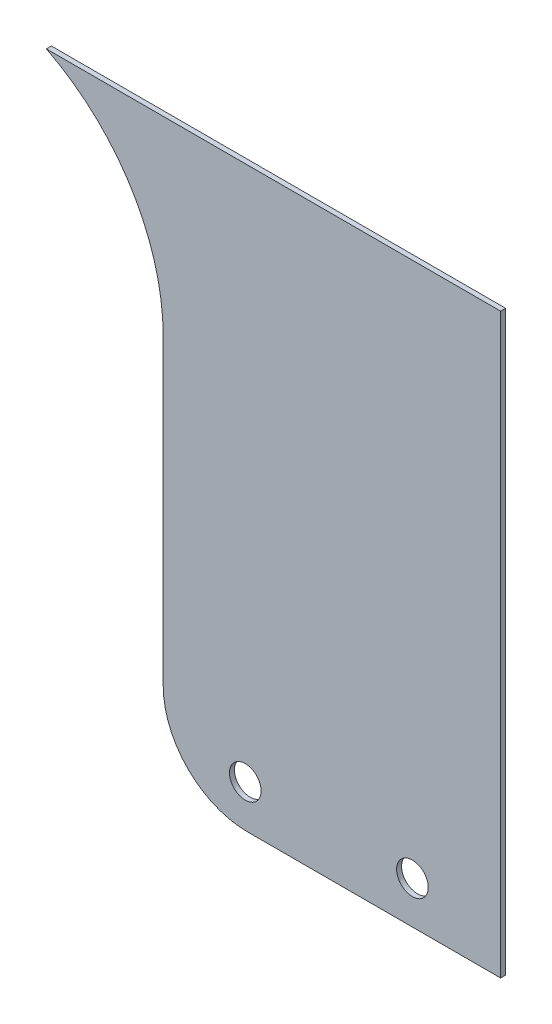
ISO-10303-21;
HEADER;
FILE_DESCRIPTION(('STEP AP214'),'2;1');
FILE_NAME('part.step','',(''),(''),'','','');
FILE_SCHEMA(('AUTOMOTIVE_DESIGN { 1 0 10303 214 1 1 1 1 }'));
ENDSEC;
DATA;
#1=APPLICATION_CONTEXT('core data for automotive mechanical design processes');
#2=APPLICATION_PROTOCOL_DEFINITION('international standard','automotive_design',2000,#1);
#3=PRODUCT_CONTEXT('',#1,'mechanical');
#4=PRODUCT('Part','Part','',(#3));
#5=PRODUCT_RELATED_PRODUCT_CATEGORY('part','',(#4));
#6=PRODUCT_DEFINITION_FORMATION('','',#4);
#7=PRODUCT_DEFINITION_CONTEXT('part definition',#1,'design');
#8=PRODUCT_DEFINITION('design','',#6,#7);
#9=PRODUCT_DEFINITION_SHAPE('','',#8);
#10=(LENGTH_UNIT() NAMED_UNIT(*) SI_UNIT(.MILLI.,.METRE.));
#11=(NAMED_UNIT(*) PLANE_ANGLE_UNIT() SI_UNIT($,.RADIAN.));
#12=(NAMED_UNIT(*) SI_UNIT($,.STERADIAN.) SOLID_ANGLE_UNIT());
#13=UNCERTAINTY_MEASURE_WITH_UNIT(LENGTH_MEASURE(1.E-05),#10,'distance_accuracy_value','');
#14=(GEOMETRIC_REPRESENTATION_CONTEXT(3) GLOBAL_UNCERTAINTY_ASSIGNED_CONTEXT((#13)) GLOBAL_UNIT_ASSIGNED_CONTEXT((#10,
#11,#12)) REPRESENTATION_CONTEXT('',''));
#15=CARTESIAN_POINT('',(0.,0.,0.));
#16=DIRECTION('',(0.,0.,1.));
#17=DIRECTION('',(1.,0.,0.));
#18=AXIS2_PLACEMENT_3D('',#15,#16,#17);
#19=CARTESIAN_POINT('',(-494.375,813.93,166.6));
#20=DIRECTION('',(0.,0.,-1.));
#21=DIRECTION('',(-1.,0.,0.));
#22=AXIS2_PLACEMENT_3D('',#19,#20,#21);
#23=PLANE('',#22);
#24=CARTESIAN_POINT('',(-444.7375,801.23,166.6));
#25=DIRECTION('',(0.,0.,1.));
#26=DIRECTION('',(1.,0.,0.));
#27=AXIS2_PLACEMENT_3D('',#24,#25,#26);
#28=CIRCLE('',#27,4.76250000000003);
#29=CARTESIAN_POINT('',(-439.975,801.23,166.6));
#30=VERTEX_POINT('',#29);
#31=EDGE_CURVE('E147',#30,#30,#28,.T.);
#32=ORIENTED_EDGE('',*,*,#31,.F.);
#33=EDGE_LOOP('',(#32));
#34=FACE_BOUND('',#33,.T.);
#35=DIRECTION('',(0.,1.,0.));
#36=VECTOR('',#35,1.);
#37=CARTESIAN_POINT('',(-418.175,962.43,166.6));
#38=LINE('',#37,#36);
#39=CARTESIAN_POINT('',(-418.175,788.53,166.6));
#40=VERTEX_POINT('',#39);
#41=CARTESIAN_POINT('',(-418.175,962.43,166.6));
#42=VERTEX_POINT('',#41);
#43=EDGE_CURVE('E158',#40,#42,#38,.T.);
#44=ORIENTED_EDGE('',*,*,#43,.T.);
#45=DIRECTION('',(-1.,0.,0.));
#46=VECTOR('',#45,1.);
#47=CARTESIAN_POINT('',(-418.175,962.43,166.6));
#48=LINE('',#47,#46);
#49=CARTESIAN_POINT('',(-554.955743447679,962.43,166.6));
#50=VERTEX_POINT('',#49);
#51=EDGE_CURVE('E104',#42,#50,#48,.T.);
#52=ORIENTED_EDGE('',*,*,#51,.T.);
#53=CARTESIAN_POINT('',(-584.199999999973,905.024825288131,166.6));
#54=DIRECTION('',(0.,0.,-1.));
#55=DIRECTION('',(1.,0.,0.));
#56=AXIS2_PLACEMENT_3D('',#53,#54,#55);
#57=CIRCLE('',#56,64.4249999999732);
#58=CARTESIAN_POINT('',(-519.775,905.024825288126,166.6));
#59=VERTEX_POINT('',#58);
#60=EDGE_CURVE('E119',#50,#59,#57,.T.);
#61=ORIENTED_EDGE('',*,*,#60,.T.);
#62=DIRECTION('',(0.,-1.,0.));
#63=VECTOR('',#62,1.);
#64=CARTESIAN_POINT('',(-519.775,813.93,166.6));
#65=LINE('',#64,#63);
#66=CARTESIAN_POINT('',(-519.775,813.93,166.6));
#67=VERTEX_POINT('',#66);
#68=EDGE_CURVE('E113',#59,#67,#65,.T.);
#69=ORIENTED_EDGE('',*,*,#68,.T.);
#70=CARTESIAN_POINT('',(-494.375,813.93,166.6));
#71=DIRECTION('',(0.,0.,1.));
#72=DIRECTION('',(-1.,0.,0.));
#73=AXIS2_PLACEMENT_3D('',#70,#71,#72);
#74=CIRCLE('',#73,25.4);
#75=CARTESIAN_POINT('',(-494.375,788.53,166.6));
#76=VERTEX_POINT('',#75);
#77=EDGE_CURVE('E117',#67,#76,#74,.T.);
#78=ORIENTED_EDGE('',*,*,#77,.T.);
#79=DIRECTION('',(1.,0.,0.));
#80=VECTOR('',#79,1.);
#81=CARTESIAN_POINT('',(-418.175,788.53,166.6));
#82=LINE('',#81,#80);
#83=EDGE_CURVE('E59',#76,#40,#82,.T.);
#84=ORIENTED_EDGE('',*,*,#83,.T.);
#85=EDGE_LOOP('',(#44,#52,#61,#69,#78,#84));
#86=FACE_BOUND('',#85,.T.);
#87=CARTESIAN_POINT('',(-495.0625,801.23,166.6));
#88=DIRECTION('',(0.,0.,1.));
#89=DIRECTION('',(1.,0.,0.));
#90=AXIS2_PLACEMENT_3D('',#87,#88,#89);
#91=CIRCLE('',#90,4.76250000000003);
#92=CARTESIAN_POINT('',(-490.3,801.23,166.6));
#93=VERTEX_POINT('',#92);
#94=EDGE_CURVE('E207',#93,#93,#91,.T.);
#95=ORIENTED_EDGE('',*,*,#94,.F.);
#96=EDGE_LOOP('',(#95));
#97=FACE_BOUND('',#96,.T.);
#98=ADVANCED_FACE('F39',(#34,#86,#97),#23,.F.);
#99=CARTESIAN_POINT('',(-494.375,813.93,165.1));
#100=DIRECTION('',(0.,0.,-1.));
#101=DIRECTION('',(-1.,0.,0.));
#102=AXIS2_PLACEMENT_3D('',#99,#100,#101);
#103=PLANE('',#102);
#104=CARTESIAN_POINT('',(-444.7375,801.23,165.1));
#105=DIRECTION('',(0.,0.,1.));
#106=DIRECTION('',(1.,0.,0.));
#107=AXIS2_PLACEMENT_3D('',#104,#105,#106);
#108=CIRCLE('',#107,4.76250000000003);
#109=CARTESIAN_POINT('',(-439.975,801.23,165.1));
#110=VERTEX_POINT('',#109);
#111=EDGE_CURVE('E215',#110,#110,#108,.T.);
#112=ORIENTED_EDGE('',*,*,#111,.T.);
#113=EDGE_LOOP('',(#112));
#114=FACE_BOUND('',#113,.T.);
#115=DIRECTION('',(0.,1.,0.));
#116=VECTOR('',#115,1.);
#117=CARTESIAN_POINT('',(-418.175,962.43,165.1));
#118=LINE('',#117,#116);
#119=CARTESIAN_POINT('',(-418.175,788.53,165.1));
#120=VERTEX_POINT('',#119);
#121=CARTESIAN_POINT('',(-418.175,962.43,165.1));
#122=VERTEX_POINT('',#121);
#123=EDGE_CURVE('E142',#120,#122,#118,.T.);
#124=ORIENTED_EDGE('',*,*,#123,.F.);
#125=DIRECTION('',(1.,0.,0.));
#126=VECTOR('',#125,1.);
#127=CARTESIAN_POINT('',(-418.175,788.53,165.1));
#128=LINE('',#127,#126);
#129=CARTESIAN_POINT('',(-494.375,788.53,165.1));
#130=VERTEX_POINT('',#129);
#131=EDGE_CURVE('E94',#130,#120,#128,.T.);
#132=ORIENTED_EDGE('',*,*,#131,.F.);
#133=CARTESIAN_POINT('',(-494.375,813.93,165.1));
#134=DIRECTION('',(0.,0.,1.));
#135=DIRECTION('',(-1.,0.,0.));
#136=AXIS2_PLACEMENT_3D('',#133,#134,#135);
#137=CIRCLE('',#136,25.4);
#138=CARTESIAN_POINT('',(-519.775,813.93,165.1));
#139=VERTEX_POINT('',#138);
#140=EDGE_CURVE('E88',#139,#130,#137,.T.);
#141=ORIENTED_EDGE('',*,*,#140,.F.);
#142=DIRECTION('',(0.,-1.,0.));
#143=VECTOR('',#142,1.);
#144=CARTESIAN_POINT('',(-519.775,813.93,165.1));
#145=LINE('',#144,#143);
#146=CARTESIAN_POINT('',(-519.775,905.024825288126,165.1));
#147=VERTEX_POINT('',#146);
#148=EDGE_CURVE('E128',#147,#139,#145,.T.);
#149=ORIENTED_EDGE('',*,*,#148,.F.);
#150=CARTESIAN_POINT('',(-584.199999999973,905.024825288131,165.1));
#151=DIRECTION('',(0.,0.,-1.));
#152=DIRECTION('',(1.,0.,0.));
#153=AXIS2_PLACEMENT_3D('',#150,#151,#152);
#154=CIRCLE('',#153,64.4249999999732);
#155=CARTESIAN_POINT('',(-554.955743447679,962.43,165.1));
#156=VERTEX_POINT('',#155);
#157=EDGE_CURVE('E150',#156,#147,#154,.T.);
#158=ORIENTED_EDGE('',*,*,#157,.F.);
#159=DIRECTION('',(-1.,0.,0.));
#160=VECTOR('',#159,1.);
#161=CARTESIAN_POINT('',(-418.175,962.43,165.1));
#162=LINE('',#161,#160);
#163=EDGE_CURVE('E146',#122,#156,#162,.T.);
#164=ORIENTED_EDGE('',*,*,#163,.F.);
#165=EDGE_LOOP('',(#124,#132,#141,#149,#158,#164));
#166=FACE_BOUND('',#165,.T.);
#167=CARTESIAN_POINT('',(-495.0625,801.23,165.1));
#168=DIRECTION('',(0.,0.,1.));
#169=DIRECTION('',(1.,0.,0.));
#170=AXIS2_PLACEMENT_3D('',#167,#168,#169);
#171=CIRCLE('',#170,4.76250000000003);
#172=CARTESIAN_POINT('',(-490.3,801.23,165.1));
#173=VERTEX_POINT('',#172);
#174=EDGE_CURVE('E210',#173,#173,#171,.T.);
#175=ORIENTED_EDGE('',*,*,#174,.T.);
#176=EDGE_LOOP('',(#175));
#177=FACE_BOUND('',#176,.T.);
#178=ADVANCED_FACE('F173',(#114,#166,#177),#103,.T.);
#179=CARTESIAN_POINT('',(-418.175,962.43,166.6));
#180=DIRECTION('',(-1.,0.,0.));
#181=DIRECTION('',(0.,0.,1.));
#182=AXIS2_PLACEMENT_3D('',#179,#180,#181);
#183=PLANE('',#182);
#184=ORIENTED_EDGE('',*,*,#123,.T.);
#185=DIRECTION('',(0.,0.,-1.));
#186=VECTOR('',#185,1.);
#187=CARTESIAN_POINT('',(-418.175,962.43,166.6));
#188=LINE('',#187,#186);
#189=EDGE_CURVE('E11',#42,#122,#188,.T.);
#190=ORIENTED_EDGE('',*,*,#189,.F.);
#191=ORIENTED_EDGE('',*,*,#43,.F.);
#192=DIRECTION('',(0.,0.,-1.));
#193=VECTOR('',#192,1.);
#194=CARTESIAN_POINT('',(-418.175,788.53,166.6));
#195=LINE('',#194,#193);
#196=EDGE_CURVE('E138',#40,#120,#195,.T.);
#197=ORIENTED_EDGE('',*,*,#196,.T.);
#198=EDGE_LOOP('',(#184,#190,#191,#197));
#199=FACE_BOUND('',#198,.T.);
#200=ADVANCED_FACE('F41',(#199),#183,.F.);
#201=CARTESIAN_POINT('',(-418.175,962.43,166.6));
#202=DIRECTION('',(0.,-1.,0.));
#203=DIRECTION('',(0.,0.,-1.));
#204=AXIS2_PLACEMENT_3D('',#201,#202,#203);
#205=PLANE('',#204);
#206=ORIENTED_EDGE('',*,*,#163,.T.);
#207=DIRECTION('',(0.,0.,-1.));
#208=VECTOR('',#207,1.);
#209=CARTESIAN_POINT('',(-554.955743447679,962.43,166.6));
#210=LINE('',#209,#208);
#211=EDGE_CURVE('E49',#50,#156,#210,.T.);
#212=ORIENTED_EDGE('',*,*,#211,.F.);
#213=ORIENTED_EDGE('',*,*,#51,.F.);
#214=ORIENTED_EDGE('',*,*,#189,.T.);
#215=EDGE_LOOP('',(#206,#212,#213,#214));
#216=FACE_BOUND('',#215,.T.);
#217=ADVANCED_FACE('F258',(#216),#205,.F.);
#218=CARTESIAN_POINT('',(-584.199999999973,905.024825288131,166.6));
#219=DIRECTION('',(0.,0.,-1.));
#220=DIRECTION('',(-1.,0.,0.));
#221=AXIS2_PLACEMENT_3D('',#218,#219,#220);
#222=CYLINDRICAL_SURFACE('',#221,64.4249999999732);
#223=ORIENTED_EDGE('',*,*,#157,.T.);
#224=DIRECTION('',(0.,0.,-1.));
#225=VECTOR('',#224,1.);
#226=CARTESIAN_POINT('',(-519.775,905.024825288126,166.6));
#227=LINE('',#226,#225);
#228=EDGE_CURVE('E130',#59,#147,#227,.T.);
#229=ORIENTED_EDGE('',*,*,#228,.F.);
#230=ORIENTED_EDGE('',*,*,#60,.F.);
#231=ORIENTED_EDGE('',*,*,#211,.T.);
#232=EDGE_LOOP('',(#223,#229,#230,#231));
#233=FACE_BOUND('',#232,.T.);
#234=ADVANCED_FACE('F170',(#233),#222,.F.);
#235=CARTESIAN_POINT('',(-519.775,813.93,166.6));
#236=DIRECTION('',(1.,0.,0.));
#237=DIRECTION('',(0.,0.,-1.));
#238=AXIS2_PLACEMENT_3D('',#235,#236,#237);
#239=PLANE('',#238);
#240=ORIENTED_EDGE('',*,*,#148,.T.);
#241=DIRECTION('',(0.,0.,-1.));
#242=VECTOR('',#241,1.);
#243=CARTESIAN_POINT('',(-519.775,813.93,166.6));
#244=LINE('',#243,#242);
#245=EDGE_CURVE('E125',#67,#139,#244,.T.);
#246=ORIENTED_EDGE('',*,*,#245,.F.);
#247=ORIENTED_EDGE('',*,*,#68,.F.);
#248=ORIENTED_EDGE('',*,*,#228,.T.);
#249=EDGE_LOOP('',(#240,#246,#247,#248));
#250=FACE_BOUND('',#249,.T.);
#251=ADVANCED_FACE('F126',(#250),#239,.F.);
#252=CARTESIAN_POINT('',(-494.375,813.93,166.6));
#253=DIRECTION('',(0.,0.,-1.));
#254=DIRECTION('',(-1.,0.,0.));
#255=AXIS2_PLACEMENT_3D('',#252,#253,#254);
#256=CYLINDRICAL_SURFACE('',#255,25.4);
#257=ORIENTED_EDGE('',*,*,#140,.T.);
#258=DIRECTION('',(0.,0.,-1.));
#259=VECTOR('',#258,1.);
#260=CARTESIAN_POINT('',(-494.375,788.53,166.6));
#261=LINE('',#260,#259);
#262=EDGE_CURVE('E131',#76,#130,#261,.T.);
#263=ORIENTED_EDGE('',*,*,#262,.F.);
#264=ORIENTED_EDGE('',*,*,#77,.F.);
#265=ORIENTED_EDGE('',*,*,#245,.T.);
#266=EDGE_LOOP('',(#257,#263,#264,#265));
#267=FACE_BOUND('',#266,.T.);
#268=ADVANCED_FACE('F133',(#267),#256,.T.);
#269=CARTESIAN_POINT('',(-418.175,788.53,166.6));
#270=DIRECTION('',(0.,1.,0.));
#271=DIRECTION('',(0.,0.,1.));
#272=AXIS2_PLACEMENT_3D('',#269,#270,#271);
#273=PLANE('',#272);
#274=ORIENTED_EDGE('',*,*,#131,.T.);
#275=ORIENTED_EDGE('',*,*,#196,.F.);
#276=ORIENTED_EDGE('',*,*,#83,.F.);
#277=ORIENTED_EDGE('',*,*,#262,.T.);
#278=EDGE_LOOP('',(#274,#275,#276,#277));
#279=FACE_BOUND('',#278,.T.);
#280=ADVANCED_FACE('F178',(#279),#273,.F.);
#281=CARTESIAN_POINT('',(-444.7375,801.23,166.6));
#282=DIRECTION('',(0.,0.,-1.));
#283=DIRECTION('',(-1.,0.,0.));
#284=AXIS2_PLACEMENT_3D('',#281,#282,#283);
#285=CYLINDRICAL_SURFACE('',#284,4.76250000000003);
#286=ORIENTED_EDGE('',*,*,#31,.T.);
#287=EDGE_LOOP('',(#286));
#288=FACE_BOUND('',#287,.T.);
#289=ORIENTED_EDGE('',*,*,#111,.F.);
#290=EDGE_LOOP('',(#289));
#291=FACE_BOUND('',#290,.T.);
#292=ADVANCED_FACE('F180',(#288,#291),#285,.F.);
#293=CARTESIAN_POINT('',(-495.0625,801.23,166.6));
#294=DIRECTION('',(0.,0.,-1.));
#295=DIRECTION('',(-1.,0.,0.));
#296=AXIS2_PLACEMENT_3D('',#293,#294,#295);
#297=CYLINDRICAL_SURFACE('',#296,4.76250000000003);
#298=ORIENTED_EDGE('',*,*,#94,.T.);
#299=EDGE_LOOP('',(#298));
#300=FACE_BOUND('',#299,.T.);
#301=ORIENTED_EDGE('',*,*,#174,.F.);
#302=EDGE_LOOP('',(#301));
#303=FACE_BOUND('',#302,.T.);
#304=ADVANCED_FACE('F186',(#300,#303),#297,.F.);
#305=CLOSED_SHELL('',(#98,#178,#200,#217,#234,#251,#268,#280,#292,#304));
#306=MANIFOLD_SOLID_BREP('B2',#305);
#307=ADVANCED_BREP_SHAPE_REPRESENTATION('',(#18,#306),#14);
#308=SHAPE_DEFINITION_REPRESENTATION(#9,#307);
ENDSEC;
END-ISO-10303-21;
